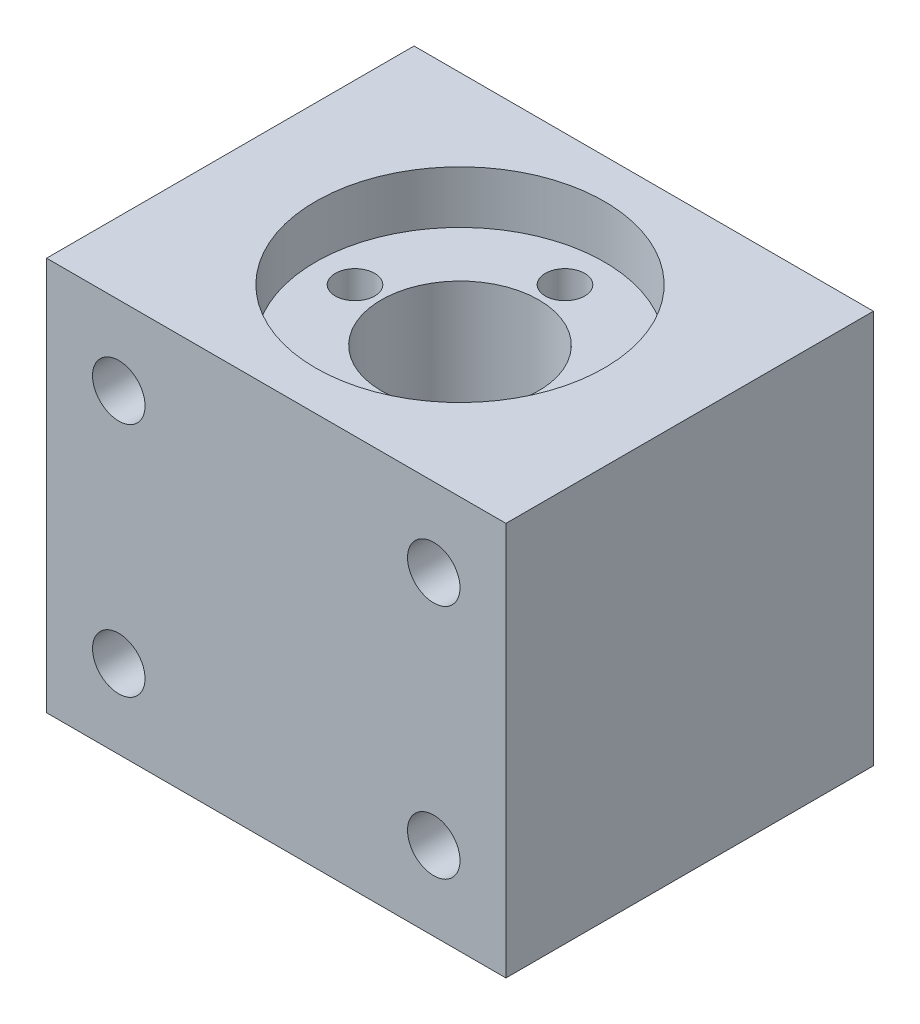
ISO-10303-21;
HEADER;
FILE_DESCRIPTION(('STEP AP214'),'2;1');
FILE_NAME('part.step','',(''),(''),'','','');
FILE_SCHEMA(('AUTOMOTIVE_DESIGN { 1 0 10303 214 1 1 1 1 }'));
ENDSEC;
DATA;
#1=APPLICATION_CONTEXT('core data for automotive mechanical design processes');
#2=APPLICATION_PROTOCOL_DEFINITION('international standard','automotive_design',2000,#1);
#3=PRODUCT_CONTEXT('',#1,'mechanical');
#4=PRODUCT('Part','Part','',(#3));
#5=PRODUCT_RELATED_PRODUCT_CATEGORY('part','',(#4));
#6=PRODUCT_DEFINITION_FORMATION('','',#4);
#7=PRODUCT_DEFINITION_CONTEXT('part definition',#1,'design');
#8=PRODUCT_DEFINITION('design','',#6,#7);
#9=PRODUCT_DEFINITION_SHAPE('','',#8);
#10=(LENGTH_UNIT() NAMED_UNIT(*) SI_UNIT(.MILLI.,.METRE.));
#11=(NAMED_UNIT(*) PLANE_ANGLE_UNIT() SI_UNIT($,.RADIAN.));
#12=(NAMED_UNIT(*) SI_UNIT($,.STERADIAN.) SOLID_ANGLE_UNIT());
#13=UNCERTAINTY_MEASURE_WITH_UNIT(LENGTH_MEASURE(1.E-05),#10,'distance_accuracy_value','');
#14=(GEOMETRIC_REPRESENTATION_CONTEXT(3) GLOBAL_UNCERTAINTY_ASSIGNED_CONTEXT((#13)) GLOBAL_UNIT_ASSIGNED_CONTEXT((#10,
#11,#12)) REPRESENTATION_CONTEXT('',''));
#15=CARTESIAN_POINT('',(0.,0.,0.));
#16=DIRECTION('',(0.,0.,1.));
#17=DIRECTION('',(1.,0.,0.));
#18=AXIS2_PLACEMENT_3D('',#15,#16,#17);
#19=CARTESIAN_POINT('',(17.5,58.,14.));
#20=DIRECTION('',(0.,-1.,0.));
#21=DIRECTION('',(0.,0.,-1.));
#22=AXIS2_PLACEMENT_3D('',#19,#20,#21);
#23=CYLINDRICAL_SURFACE('',#22,6.);
#24=CARTESIAN_POINT('',(17.5,8.,14.));
#25=DIRECTION('',(0.,-1.,0.));
#26=DIRECTION('',(0.,0.,-1.));
#27=AXIS2_PLACEMENT_3D('',#24,#25,#26);
#28=CIRCLE('',#27,6.);
#29=CARTESIAN_POINT('',(17.5,8.,8.));
#30=VERTEX_POINT('',#29);
#31=EDGE_CURVE('E145',#30,#30,#28,.T.);
#32=ORIENTED_EDGE('',*,*,#31,.T.);
#33=EDGE_LOOP('',(#32));
#34=FACE_BOUND('',#33,.T.);
#35=CARTESIAN_POINT('',(17.5,26.,14.));
#36=DIRECTION('',(0.,1.,0.));
#37=DIRECTION('',(0.,0.,1.));
#38=AXIS2_PLACEMENT_3D('',#35,#36,#37);
#39=CIRCLE('',#38,6.);
#40=CARTESIAN_POINT('',(17.5,26.,20.));
#41=VERTEX_POINT('',#40);
#42=EDGE_CURVE('E42',#41,#41,#39,.F.);
#43=ORIENTED_EDGE('',*,*,#42,.F.);
#44=EDGE_LOOP('',(#43));
#45=FACE_BOUND('',#44,.T.);
#46=ADVANCED_FACE('F38',(#34,#45),#23,.F.);
#47=CARTESIAN_POINT('',(0.,0.,28.));
#48=DIRECTION('',(1.,0.,0.));
#49=DIRECTION('',(0.,0.,-1.));
#50=AXIS2_PLACEMENT_3D('',#47,#48,#49);
#51=PLANE('',#50);
#52=DIRECTION('',(0.,-1.,0.));
#53=VECTOR('',#52,1.);
#54=CARTESIAN_POINT('',(0.,0.,0.));
#55=LINE('',#54,#53);
#56=CARTESIAN_POINT('',(0.,30.,0.));
#57=VERTEX_POINT('',#56);
#58=CARTESIAN_POINT('',(0.,0.,0.));
#59=VERTEX_POINT('',#58);
#60=EDGE_CURVE('E104',#57,#59,#55,.T.);
#61=ORIENTED_EDGE('',*,*,#60,.T.);
#62=DIRECTION('',(0.,0.,-1.));
#63=VECTOR('',#62,1.);
#64=CARTESIAN_POINT('',(0.,0.,28.));
#65=LINE('',#64,#63);
#66=CARTESIAN_POINT('',(0.,0.,28.));
#67=VERTEX_POINT('',#66);
#68=EDGE_CURVE('E11',#67,#59,#65,.T.);
#69=ORIENTED_EDGE('',*,*,#68,.F.);
#70=DIRECTION('',(0.,-1.,0.));
#71=VECTOR('',#70,1.);
#72=CARTESIAN_POINT('',(0.,0.,28.));
#73=LINE('',#72,#71);
#74=CARTESIAN_POINT('',(0.,30.,28.));
#75=VERTEX_POINT('',#74);
#76=EDGE_CURVE('E91',#75,#67,#73,.T.);
#77=ORIENTED_EDGE('',*,*,#76,.F.);
#78=DIRECTION('',(0.,0.,-1.));
#79=VECTOR('',#78,1.);
#80=CARTESIAN_POINT('',(0.,30.,28.));
#81=LINE('',#80,#79);
#82=EDGE_CURVE('E100',#75,#57,#81,.T.);
#83=ORIENTED_EDGE('',*,*,#82,.T.);
#84=EDGE_LOOP('',(#61,#69,#77,#83));
#85=FACE_BOUND('',#84,.T.);
#86=ADVANCED_FACE('F40',(#85),#51,.F.);
#87=CARTESIAN_POINT('',(0.,0.,28.));
#88=DIRECTION('',(0.,1.,0.));
#89=DIRECTION('',(0.,0.,1.));
#90=AXIS2_PLACEMENT_3D('',#87,#88,#89);
#91=PLANE('',#90);
#92=CARTESIAN_POINT('',(17.5,0.,14.));
#93=DIRECTION('',(0.,-1.,0.));
#94=DIRECTION('',(0.,0.,-1.));
#95=AXIS2_PLACEMENT_3D('',#92,#93,#94);
#96=CIRCLE('',#95,7.);
#97=CARTESIAN_POINT('',(17.5,0.,7.));
#98=VERTEX_POINT('',#97);
#99=EDGE_CURVE('E142',#98,#98,#96,.T.);
#100=ORIENTED_EDGE('',*,*,#99,.F.);
#101=EDGE_LOOP('',(#100));
#102=FACE_BOUND('',#101,.T.);
#103=DIRECTION('',(1.,0.,0.));
#104=VECTOR('',#103,1.);
#105=CARTESIAN_POINT('',(0.,0.,0.));
#106=LINE('',#105,#104);
#107=CARTESIAN_POINT('',(35.,0.,0.));
#108=VERTEX_POINT('',#107);
#109=EDGE_CURVE('E95',#59,#108,#106,.T.);
#110=ORIENTED_EDGE('',*,*,#109,.T.);
#111=DIRECTION('',(0.,0.,-1.));
#112=VECTOR('',#111,1.);
#113=CARTESIAN_POINT('',(35.,0.,28.));
#114=LINE('',#113,#112);
#115=CARTESIAN_POINT('',(35.,0.,28.));
#116=VERTEX_POINT('',#115);
#117=EDGE_CURVE('E48',#116,#108,#114,.T.);
#118=ORIENTED_EDGE('',*,*,#117,.F.);
#119=DIRECTION('',(1.,0.,0.));
#120=VECTOR('',#119,1.);
#121=CARTESIAN_POINT('',(0.,0.,28.));
#122=LINE('',#121,#120);
#123=EDGE_CURVE('E86',#67,#116,#122,.T.);
#124=ORIENTED_EDGE('',*,*,#123,.F.);
#125=ORIENTED_EDGE('',*,*,#68,.T.);
#126=EDGE_LOOP('',(#110,#118,#124,#125));
#127=FACE_BOUND('',#126,.T.);
#128=ADVANCED_FACE('F94',(#102,#127),#91,.F.);
#129=CARTESIAN_POINT('',(35.,0.,28.));
#130=DIRECTION('',(-1.,0.,0.));
#131=DIRECTION('',(0.,0.,1.));
#132=AXIS2_PLACEMENT_3D('',#129,#130,#131);
#133=PLANE('',#132);
#134=DIRECTION('',(0.,1.,0.));
#135=VECTOR('',#134,1.);
#136=CARTESIAN_POINT('',(35.,0.,0.));
#137=LINE('',#136,#135);
#138=CARTESIAN_POINT('',(35.,30.,0.));
#139=VERTEX_POINT('',#138);
#140=EDGE_CURVE('E73',#108,#139,#137,.T.);
#141=ORIENTED_EDGE('',*,*,#140,.T.);
#142=DIRECTION('',(0.,0.,-1.));
#143=VECTOR('',#142,1.);
#144=CARTESIAN_POINT('',(35.,30.,28.));
#145=LINE('',#144,#143);
#146=CARTESIAN_POINT('',(35.,30.,28.));
#147=VERTEX_POINT('',#146);
#148=EDGE_CURVE('E96',#147,#139,#145,.T.);
#149=ORIENTED_EDGE('',*,*,#148,.F.);
#150=DIRECTION('',(0.,1.,0.));
#151=VECTOR('',#150,1.);
#152=CARTESIAN_POINT('',(35.,0.,28.));
#153=LINE('',#152,#151);
#154=EDGE_CURVE('E89',#116,#147,#153,.T.);
#155=ORIENTED_EDGE('',*,*,#154,.F.);
#156=ORIENTED_EDGE('',*,*,#117,.T.);
#157=EDGE_LOOP('',(#141,#149,#155,#156));
#158=FACE_BOUND('',#157,.T.);
#159=ADVANCED_FACE('F98',(#158),#133,.F.);
#160=CARTESIAN_POINT('',(0.,30.,28.));
#161=DIRECTION('',(0.,-1.,0.));
#162=DIRECTION('',(0.,0.,-1.));
#163=AXIS2_PLACEMENT_3D('',#160,#161,#162);
#164=PLANE('',#163);
#165=CARTESIAN_POINT('',(17.5,30.,14.));
#166=DIRECTION('',(0.,1.,0.));
#167=DIRECTION('',(0.,0.,1.));
#168=AXIS2_PLACEMENT_3D('',#165,#166,#167);
#169=CIRCLE('',#168,11.);
#170=CARTESIAN_POINT('',(17.5,30.,25.));
#171=VERTEX_POINT('',#170);
#172=EDGE_CURVE('E150',#171,#171,#169,.T.);
#173=ORIENTED_EDGE('',*,*,#172,.F.);
#174=EDGE_LOOP('',(#173));
#175=FACE_BOUND('',#174,.T.);
#176=DIRECTION('',(-1.,0.,0.));
#177=VECTOR('',#176,1.);
#178=CARTESIAN_POINT('',(0.,30.,0.));
#179=LINE('',#178,#177);
#180=EDGE_CURVE('E79',#139,#57,#179,.T.);
#181=ORIENTED_EDGE('',*,*,#180,.T.);
#182=ORIENTED_EDGE('',*,*,#82,.F.);
#183=DIRECTION('',(-1.,0.,0.));
#184=VECTOR('',#183,1.);
#185=CARTESIAN_POINT('',(0.,30.,28.));
#186=LINE('',#185,#184);
#187=EDGE_CURVE('E56',#147,#75,#186,.T.);
#188=ORIENTED_EDGE('',*,*,#187,.F.);
#189=ORIENTED_EDGE('',*,*,#148,.T.);
#190=EDGE_LOOP('',(#181,#182,#188,#189));
#191=FACE_BOUND('',#190,.T.);
#192=ADVANCED_FACE('F112',(#175,#191),#164,.F.);
#193=CARTESIAN_POINT('',(0.,0.,28.));
#194=DIRECTION('',(0.,0.,-1.));
#195=DIRECTION('',(-1.,0.,0.));
#196=AXIS2_PLACEMENT_3D('',#193,#194,#195);
#197=PLANE('',#196);
#198=CARTESIAN_POINT('',(29.5,24.,28.));
#199=DIRECTION('',(0.,0.,1.));
#200=DIRECTION('',(1.,0.,0.));
#201=AXIS2_PLACEMENT_3D('',#198,#199,#200);
#202=CIRCLE('',#201,2.);
#203=CARTESIAN_POINT('',(31.5,24.,28.));
#204=VERTEX_POINT('',#203);
#205=EDGE_CURVE('E124',#204,#204,#202,.T.);
#206=ORIENTED_EDGE('',*,*,#205,.F.);
#207=EDGE_LOOP('',(#206));
#208=FACE_BOUND('',#207,.T.);
#209=CARTESIAN_POINT('',(29.5,6.,28.));
#210=DIRECTION('',(0.,0.,1.));
#211=DIRECTION('',(1.,0.,0.));
#212=AXIS2_PLACEMENT_3D('',#209,#210,#211);
#213=CIRCLE('',#212,2.);
#214=CARTESIAN_POINT('',(31.5,6.,28.));
#215=VERTEX_POINT('',#214);
#216=EDGE_CURVE('E131',#215,#215,#213,.T.);
#217=ORIENTED_EDGE('',*,*,#216,.F.);
#218=EDGE_LOOP('',(#217));
#219=FACE_BOUND('',#218,.T.);
#220=CARTESIAN_POINT('',(5.5,6.,28.));
#221=DIRECTION('',(0.,0.,1.));
#222=DIRECTION('',(1.,0.,0.));
#223=AXIS2_PLACEMENT_3D('',#220,#221,#222);
#224=CIRCLE('',#223,2.);
#225=CARTESIAN_POINT('',(7.5,6.,28.));
#226=VERTEX_POINT('',#225);
#227=EDGE_CURVE('E137',#226,#226,#224,.T.);
#228=ORIENTED_EDGE('',*,*,#227,.F.);
#229=EDGE_LOOP('',(#228));
#230=FACE_BOUND('',#229,.T.);
#231=CARTESIAN_POINT('',(5.5,24.,28.));
#232=DIRECTION('',(0.,0.,1.));
#233=DIRECTION('',(1.,0.,0.));
#234=AXIS2_PLACEMENT_3D('',#231,#232,#233);
#235=CIRCLE('',#234,2.);
#236=CARTESIAN_POINT('',(7.5,24.,28.));
#237=VERTEX_POINT('',#236);
#238=EDGE_CURVE('E118',#237,#237,#235,.T.);
#239=ORIENTED_EDGE('',*,*,#238,.F.);
#240=EDGE_LOOP('',(#239));
#241=FACE_BOUND('',#240,.T.);
#242=ORIENTED_EDGE('',*,*,#76,.T.);
#243=ORIENTED_EDGE('',*,*,#123,.T.);
#244=ORIENTED_EDGE('',*,*,#154,.T.);
#245=ORIENTED_EDGE('',*,*,#187,.T.);
#246=EDGE_LOOP('',(#242,#243,#244,#245));
#247=FACE_BOUND('',#246,.T.);
#248=ADVANCED_FACE('F87',(#208,#219,#230,#241,#247),#197,.F.);
#249=CARTESIAN_POINT('',(0.,0.,0.));
#250=DIRECTION('',(0.,0.,-1.));
#251=DIRECTION('',(-1.,0.,0.));
#252=AXIS2_PLACEMENT_3D('',#249,#250,#251);
#253=PLANE('',#252);
#254=CARTESIAN_POINT('',(5.,15.,0.));
#255=DIRECTION('',(0.,0.,-1.));
#256=DIRECTION('',(-1.,0.,0.));
#257=AXIS2_PLACEMENT_3D('',#254,#255,#256);
#258=CIRCLE('',#257,1.5);
#259=CARTESIAN_POINT('',(3.5,15.,0.));
#260=VERTEX_POINT('',#259);
#261=EDGE_CURVE('E181',#260,#260,#258,.T.);
#262=ORIENTED_EDGE('',*,*,#261,.F.);
#263=EDGE_LOOP('',(#262));
#264=FACE_BOUND('',#263,.T.);
#265=ORIENTED_EDGE('',*,*,#60,.F.);
#266=ORIENTED_EDGE('',*,*,#180,.F.);
#267=ORIENTED_EDGE('',*,*,#140,.F.);
#268=ORIENTED_EDGE('',*,*,#109,.F.);
#269=EDGE_LOOP('',(#265,#266,#267,#268));
#270=FACE_BOUND('',#269,.T.);
#271=ADVANCED_FACE('F115',(#264,#270),#253,.T.);
#272=CARTESIAN_POINT('',(5.5,24.,21.));
#273=DIRECTION('',(0.,0.,1.));
#274=DIRECTION('',(1.,0.,0.));
#275=AXIS2_PLACEMENT_3D('',#272,#273,#274);
#276=CYLINDRICAL_SURFACE('',#275,2.);
#277=CARTESIAN_POINT('',(5.5,24.,21.));
#278=DIRECTION('',(0.,0.,1.));
#279=DIRECTION('',(1.,0.,0.));
#280=AXIS2_PLACEMENT_3D('',#277,#278,#279);
#281=CIRCLE('',#280,2.);
#282=CARTESIAN_POINT('',(7.5,24.,21.));
#283=VERTEX_POINT('',#282);
#284=EDGE_CURVE('E107',#283,#283,#281,.T.);
#285=ORIENTED_EDGE('',*,*,#284,.F.);
#286=EDGE_LOOP('',(#285));
#287=FACE_BOUND('',#286,.T.);
#288=ORIENTED_EDGE('',*,*,#238,.T.);
#289=EDGE_LOOP('',(#288));
#290=FACE_BOUND('',#289,.T.);
#291=ADVANCED_FACE('F197',(#287,#290),#276,.F.);
#292=CARTESIAN_POINT('',(5.5,24.,21.));
#293=DIRECTION('',(0.,0.,1.));
#294=DIRECTION('',(1.,0.,0.));
#295=AXIS2_PLACEMENT_3D('',#292,#293,#294);
#296=PLANE('',#295);
#297=ORIENTED_EDGE('',*,*,#284,.T.);
#298=EDGE_LOOP('',(#297));
#299=FACE_BOUND('',#298,.T.);
#300=ADVANCED_FACE('F203',(#299),#296,.T.);
#301=CARTESIAN_POINT('',(5.5,6.,21.));
#302=DIRECTION('',(0.,0.,1.));
#303=DIRECTION('',(1.,0.,0.));
#304=AXIS2_PLACEMENT_3D('',#301,#302,#303);
#305=CYLINDRICAL_SURFACE('',#304,2.);
#306=CARTESIAN_POINT('',(5.5,6.,21.));
#307=DIRECTION('',(0.,0.,1.));
#308=DIRECTION('',(1.,0.,0.));
#309=AXIS2_PLACEMENT_3D('',#306,#307,#308);
#310=CIRCLE('',#309,2.);
#311=CARTESIAN_POINT('',(7.5,6.,21.));
#312=VERTEX_POINT('',#311);
#313=EDGE_CURVE('E121',#312,#312,#310,.T.);
#314=ORIENTED_EDGE('',*,*,#313,.F.);
#315=EDGE_LOOP('',(#314));
#316=FACE_BOUND('',#315,.T.);
#317=ORIENTED_EDGE('',*,*,#227,.T.);
#318=EDGE_LOOP('',(#317));
#319=FACE_BOUND('',#318,.T.);
#320=ADVANCED_FACE('F234',(#316,#319),#305,.F.);
#321=CARTESIAN_POINT('',(5.5,6.,21.));
#322=DIRECTION('',(0.,0.,1.));
#323=DIRECTION('',(1.,0.,0.));
#324=AXIS2_PLACEMENT_3D('',#321,#322,#323);
#325=PLANE('',#324);
#326=ORIENTED_EDGE('',*,*,#313,.T.);
#327=EDGE_LOOP('',(#326));
#328=FACE_BOUND('',#327,.T.);
#329=ADVANCED_FACE('F230',(#328),#325,.T.);
#330=CARTESIAN_POINT('',(29.5,6.,21.));
#331=DIRECTION('',(0.,0.,1.));
#332=DIRECTION('',(1.,0.,0.));
#333=AXIS2_PLACEMENT_3D('',#330,#331,#332);
#334=CYLINDRICAL_SURFACE('',#333,2.);
#335=CARTESIAN_POINT('',(29.5,6.,21.));
#336=DIRECTION('',(0.,0.,1.));
#337=DIRECTION('',(1.,0.,0.));
#338=AXIS2_PLACEMENT_3D('',#335,#336,#337);
#339=CIRCLE('',#338,2.);
#340=CARTESIAN_POINT('',(31.5,6.,21.));
#341=VERTEX_POINT('',#340);
#342=EDGE_CURVE('E134',#341,#341,#339,.T.);
#343=ORIENTED_EDGE('',*,*,#342,.F.);
#344=EDGE_LOOP('',(#343));
#345=FACE_BOUND('',#344,.T.);
#346=ORIENTED_EDGE('',*,*,#216,.T.);
#347=EDGE_LOOP('',(#346));
#348=FACE_BOUND('',#347,.T.);
#349=ADVANCED_FACE('F233',(#345,#348),#334,.F.);
#350=CARTESIAN_POINT('',(29.5,6.,21.));
#351=DIRECTION('',(0.,0.,1.));
#352=DIRECTION('',(1.,0.,0.));
#353=AXIS2_PLACEMENT_3D('',#350,#351,#352);
#354=PLANE('',#353);
#355=ORIENTED_EDGE('',*,*,#342,.T.);
#356=EDGE_LOOP('',(#355));
#357=FACE_BOUND('',#356,.T.);
#358=ADVANCED_FACE('F239',(#357),#354,.T.);
#359=CARTESIAN_POINT('',(29.5,24.,21.));
#360=DIRECTION('',(0.,0.,1.));
#361=DIRECTION('',(1.,0.,0.));
#362=AXIS2_PLACEMENT_3D('',#359,#360,#361);
#363=CYLINDRICAL_SURFACE('',#362,2.);
#364=CARTESIAN_POINT('',(29.5,24.,21.));
#365=DIRECTION('',(0.,0.,1.));
#366=DIRECTION('',(1.,0.,0.));
#367=AXIS2_PLACEMENT_3D('',#364,#365,#366);
#368=CIRCLE('',#367,2.);
#369=CARTESIAN_POINT('',(31.5,24.,21.));
#370=VERTEX_POINT('',#369);
#371=EDGE_CURVE('E127',#370,#370,#368,.T.);
#372=ORIENTED_EDGE('',*,*,#371,.F.);
#373=EDGE_LOOP('',(#372));
#374=FACE_BOUND('',#373,.T.);
#375=ORIENTED_EDGE('',*,*,#205,.T.);
#376=EDGE_LOOP('',(#375));
#377=FACE_BOUND('',#376,.T.);
#378=ADVANCED_FACE('F242',(#374,#377),#363,.F.);
#379=CARTESIAN_POINT('',(29.5,24.,21.));
#380=DIRECTION('',(0.,0.,1.));
#381=DIRECTION('',(1.,0.,0.));
#382=AXIS2_PLACEMENT_3D('',#379,#380,#381);
#383=PLANE('',#382);
#384=ORIENTED_EDGE('',*,*,#371,.T.);
#385=EDGE_LOOP('',(#384));
#386=FACE_BOUND('',#385,.T.);
#387=ADVANCED_FACE('F228',(#386),#383,.T.);
#388=CARTESIAN_POINT('',(17.5,8.,14.));
#389=DIRECTION('',(0.,-1.,0.));
#390=DIRECTION('',(0.,0.,-1.));
#391=AXIS2_PLACEMENT_3D('',#388,#389,#390);
#392=CYLINDRICAL_SURFACE('',#391,7.);
#393=CARTESIAN_POINT('',(17.5,8.,14.));
#394=DIRECTION('',(0.,-1.,0.));
#395=DIRECTION('',(0.,0.,-1.));
#396=AXIS2_PLACEMENT_3D('',#393,#394,#395);
#397=CIRCLE('',#396,7.);
#398=CARTESIAN_POINT('',(17.5,8.,7.));
#399=VERTEX_POINT('',#398);
#400=EDGE_CURVE('E128',#399,#399,#397,.T.);
#401=ORIENTED_EDGE('',*,*,#400,.F.);
#402=EDGE_LOOP('',(#401));
#403=FACE_BOUND('',#402,.T.);
#404=ORIENTED_EDGE('',*,*,#99,.T.);
#405=EDGE_LOOP('',(#404));
#406=FACE_BOUND('',#405,.T.);
#407=ADVANCED_FACE('F224',(#403,#406),#392,.F.);
#408=CARTESIAN_POINT('',(17.5,8.,14.));
#409=DIRECTION('',(0.,-1.,0.));
#410=DIRECTION('',(0.,0.,-1.));
#411=AXIS2_PLACEMENT_3D('',#408,#409,#410);
#412=PLANE('',#411);
#413=ORIENTED_EDGE('',*,*,#31,.F.);
#414=EDGE_LOOP('',(#413));
#415=FACE_BOUND('',#414,.T.);
#416=ORIENTED_EDGE('',*,*,#400,.T.);
#417=EDGE_LOOP('',(#416));
#418=FACE_BOUND('',#417,.T.);
#419=ADVANCED_FACE('F220',(#415,#418),#412,.T.);
#420=CARTESIAN_POINT('',(17.5,26.,14.));
#421=DIRECTION('',(0.,1.,0.));
#422=DIRECTION('',(0.,0.,1.));
#423=AXIS2_PLACEMENT_3D('',#420,#421,#422);
#424=PLANE('',#423);
#425=CARTESIAN_POINT('',(17.5,26.,6.));
#426=DIRECTION('',(0.,1.,0.));
#427=DIRECTION('',(0.,0.,1.));
#428=AXIS2_PLACEMENT_3D('',#425,#426,#427);
#429=CIRCLE('',#428,1.5);
#430=CARTESIAN_POINT('',(17.5,26.,7.5));
#431=VERTEX_POINT('',#430);
#432=EDGE_CURVE('E176',#431,#431,#429,.T.);
#433=ORIENTED_EDGE('',*,*,#432,.F.);
#434=EDGE_LOOP('',(#433));
#435=FACE_BOUND('',#434,.T.);
#436=CARTESIAN_POINT('',(9.5,26.,14.));
#437=DIRECTION('',(0.,1.,0.));
#438=DIRECTION('',(0.,0.,1.));
#439=AXIS2_PLACEMENT_3D('',#436,#437,#438);
#440=CIRCLE('',#439,1.5);
#441=CARTESIAN_POINT('',(9.5,26.,15.5));
#442=VERTEX_POINT('',#441);
#443=EDGE_CURVE('E170',#442,#442,#440,.T.);
#444=ORIENTED_EDGE('',*,*,#443,.F.);
#445=EDGE_LOOP('',(#444));
#446=FACE_BOUND('',#445,.T.);
#447=CARTESIAN_POINT('',(17.5,26.,22.));
#448=DIRECTION('',(0.,1.,0.));
#449=DIRECTION('',(0.,0.,1.));
#450=AXIS2_PLACEMENT_3D('',#447,#448,#449);
#451=CIRCLE('',#450,1.5);
#452=CARTESIAN_POINT('',(17.5,26.,23.5));
#453=VERTEX_POINT('',#452);
#454=EDGE_CURVE('E164',#453,#453,#451,.T.);
#455=ORIENTED_EDGE('',*,*,#454,.F.);
#456=EDGE_LOOP('',(#455));
#457=FACE_BOUND('',#456,.T.);
#458=CARTESIAN_POINT('',(25.5,26.,14.));
#459=DIRECTION('',(0.,1.,0.));
#460=DIRECTION('',(0.,0.,1.));
#461=AXIS2_PLACEMENT_3D('',#458,#459,#460);
#462=CIRCLE('',#461,1.5);
#463=CARTESIAN_POINT('',(25.5,26.,15.5));
#464=VERTEX_POINT('',#463);
#465=EDGE_CURVE('E157',#464,#464,#462,.T.);
#466=ORIENTED_EDGE('',*,*,#465,.F.);
#467=EDGE_LOOP('',(#466));
#468=FACE_BOUND('',#467,.T.);
#469=CARTESIAN_POINT('',(17.5,26.,14.));
#470=DIRECTION('',(0.,1.,0.));
#471=DIRECTION('',(0.,0.,1.));
#472=AXIS2_PLACEMENT_3D('',#469,#470,#471);
#473=CIRCLE('',#472,11.);
#474=CARTESIAN_POINT('',(17.5,26.,25.));
#475=VERTEX_POINT('',#474);
#476=EDGE_CURVE('E153',#475,#475,#473,.T.);
#477=ORIENTED_EDGE('',*,*,#476,.T.);
#478=EDGE_LOOP('',(#477));
#479=FACE_BOUND('',#478,.T.);
#480=ORIENTED_EDGE('',*,*,#42,.T.);
#481=EDGE_LOOP('',(#480));
#482=FACE_BOUND('',#481,.T.);
#483=ADVANCED_FACE('F223',(#435,#446,#457,#468,#479,#482),#424,.T.);
#484=CARTESIAN_POINT('',(17.5,26.,14.));
#485=DIRECTION('',(0.,1.,0.));
#486=DIRECTION('',(0.,0.,1.));
#487=AXIS2_PLACEMENT_3D('',#484,#485,#486);
#488=CYLINDRICAL_SURFACE('',#487,11.);
#489=ORIENTED_EDGE('',*,*,#476,.F.);
#490=EDGE_LOOP('',(#489));
#491=FACE_BOUND('',#490,.T.);
#492=ORIENTED_EDGE('',*,*,#172,.T.);
#493=EDGE_LOOP('',(#492));
#494=FACE_BOUND('',#493,.T.);
#495=ADVANCED_FACE('F218',(#491,#494),#488,.F.);
#496=CARTESIAN_POINT('',(25.5,16.,14.));
#497=DIRECTION('',(0.,1.,0.));
#498=DIRECTION('',(0.,0.,1.));
#499=AXIS2_PLACEMENT_3D('',#496,#497,#498);
#500=CYLINDRICAL_SURFACE('',#499,1.5);
#501=CARTESIAN_POINT('',(25.5,16.,14.));
#502=DIRECTION('',(0.,1.,0.));
#503=DIRECTION('',(0.,0.,1.));
#504=AXIS2_PLACEMENT_3D('',#501,#502,#503);
#505=CIRCLE('',#504,1.5);
#506=CARTESIAN_POINT('',(25.5,16.,15.5));
#507=VERTEX_POINT('',#506);
#508=EDGE_CURVE('E160',#507,#507,#505,.T.);
#509=ORIENTED_EDGE('',*,*,#508,.F.);
#510=EDGE_LOOP('',(#509));
#511=FACE_BOUND('',#510,.T.);
#512=ORIENTED_EDGE('',*,*,#465,.T.);
#513=EDGE_LOOP('',(#512));
#514=FACE_BOUND('',#513,.T.);
#515=ADVANCED_FACE('F309',(#511,#514),#500,.F.);
#516=CARTESIAN_POINT('',(25.5,16.,14.));
#517=DIRECTION('',(0.,1.,0.));
#518=DIRECTION('',(0.,0.,1.));
#519=AXIS2_PLACEMENT_3D('',#516,#517,#518);
#520=PLANE('',#519);
#521=ORIENTED_EDGE('',*,*,#508,.T.);
#522=EDGE_LOOP('',(#521));
#523=FACE_BOUND('',#522,.T.);
#524=ADVANCED_FACE('F316',(#523),#520,.T.);
#525=CARTESIAN_POINT('',(17.5,16.,22.));
#526=DIRECTION('',(0.,1.,0.));
#527=DIRECTION('',(0.,0.,1.));
#528=AXIS2_PLACEMENT_3D('',#525,#526,#527);
#529=CYLINDRICAL_SURFACE('',#528,1.5);
#530=CARTESIAN_POINT('',(17.5,16.,22.));
#531=DIRECTION('',(0.,1.,0.));
#532=DIRECTION('',(0.,0.,1.));
#533=AXIS2_PLACEMENT_3D('',#530,#531,#532);
#534=CIRCLE('',#533,1.5);
#535=CARTESIAN_POINT('',(17.5,16.,23.5));
#536=VERTEX_POINT('',#535);
#537=EDGE_CURVE('E167',#536,#536,#534,.T.);
#538=ORIENTED_EDGE('',*,*,#537,.F.);
#539=EDGE_LOOP('',(#538));
#540=FACE_BOUND('',#539,.T.);
#541=ORIENTED_EDGE('',*,*,#454,.T.);
#542=EDGE_LOOP('',(#541));
#543=FACE_BOUND('',#542,.T.);
#544=ADVANCED_FACE('F324',(#540,#543),#529,.F.);
#545=CARTESIAN_POINT('',(17.5,16.,22.));
#546=DIRECTION('',(0.,1.,0.));
#547=DIRECTION('',(0.,0.,1.));
#548=AXIS2_PLACEMENT_3D('',#545,#546,#547);
#549=PLANE('',#548);
#550=ORIENTED_EDGE('',*,*,#537,.T.);
#551=EDGE_LOOP('',(#550));
#552=FACE_BOUND('',#551,.T.);
#553=ADVANCED_FACE('F332',(#552),#549,.T.);
#554=CARTESIAN_POINT('',(9.5,16.,14.));
#555=DIRECTION('',(0.,1.,0.));
#556=DIRECTION('',(0.,0.,1.));
#557=AXIS2_PLACEMENT_3D('',#554,#555,#556);
#558=CYLINDRICAL_SURFACE('',#557,1.5);
#559=CARTESIAN_POINT('',(9.5,16.,14.));
#560=DIRECTION('',(0.,1.,0.));
#561=DIRECTION('',(0.,0.,1.));
#562=AXIS2_PLACEMENT_3D('',#559,#560,#561);
#563=CIRCLE('',#562,1.5);
#564=CARTESIAN_POINT('',(9.5,16.,15.5));
#565=VERTEX_POINT('',#564);
#566=EDGE_CURVE('E173',#565,#565,#563,.T.);
#567=ORIENTED_EDGE('',*,*,#566,.F.);
#568=EDGE_LOOP('',(#567));
#569=FACE_BOUND('',#568,.T.);
#570=ORIENTED_EDGE('',*,*,#443,.T.);
#571=EDGE_LOOP('',(#570));
#572=FACE_BOUND('',#571,.T.);
#573=ADVANCED_FACE('F340',(#569,#572),#558,.F.);
#574=CARTESIAN_POINT('',(9.5,16.,14.));
#575=DIRECTION('',(0.,1.,0.));
#576=DIRECTION('',(0.,0.,1.));
#577=AXIS2_PLACEMENT_3D('',#574,#575,#576);
#578=PLANE('',#577);
#579=ORIENTED_EDGE('',*,*,#566,.T.);
#580=EDGE_LOOP('',(#579));
#581=FACE_BOUND('',#580,.T.);
#582=ADVANCED_FACE('F348',(#581),#578,.T.);
#583=CARTESIAN_POINT('',(17.5,16.,6.));
#584=DIRECTION('',(0.,1.,0.));
#585=DIRECTION('',(0.,0.,1.));
#586=AXIS2_PLACEMENT_3D('',#583,#584,#585);
#587=CYLINDRICAL_SURFACE('',#586,1.5);
#588=CARTESIAN_POINT('',(17.5,16.,6.));
#589=DIRECTION('',(0.,1.,0.));
#590=DIRECTION('',(0.,0.,1.));
#591=AXIS2_PLACEMENT_3D('',#588,#589,#590);
#592=CIRCLE('',#591,1.5);
#593=CARTESIAN_POINT('',(17.5,16.,7.5));
#594=VERTEX_POINT('',#593);
#595=EDGE_CURVE('E154',#594,#594,#592,.T.);
#596=ORIENTED_EDGE('',*,*,#595,.F.);
#597=EDGE_LOOP('',(#596));
#598=FACE_BOUND('',#597,.T.);
#599=ORIENTED_EDGE('',*,*,#432,.T.);
#600=EDGE_LOOP('',(#599));
#601=FACE_BOUND('',#600,.T.);
#602=ADVANCED_FACE('F356',(#598,#601),#587,.F.);
#603=CARTESIAN_POINT('',(17.5,16.,6.));
#604=DIRECTION('',(0.,1.,0.));
#605=DIRECTION('',(0.,0.,1.));
#606=AXIS2_PLACEMENT_3D('',#603,#604,#605);
#607=PLANE('',#606);
#608=ORIENTED_EDGE('',*,*,#595,.T.);
#609=EDGE_LOOP('',(#608));
#610=FACE_BOUND('',#609,.T.);
#611=ADVANCED_FACE('F192',(#610),#607,.T.);
#612=CARTESIAN_POINT('',(5.,15.,10.));
#613=DIRECTION('',(0.,0.,-1.));
#614=DIRECTION('',(-1.,0.,0.));
#615=AXIS2_PLACEMENT_3D('',#612,#613,#614);
#616=CYLINDRICAL_SURFACE('',#615,1.5);
#617=CARTESIAN_POINT('',(5.,15.,10.));
#618=DIRECTION('',(0.,0.,-1.));
#619=DIRECTION('',(-1.,0.,0.));
#620=AXIS2_PLACEMENT_3D('',#617,#618,#619);
#621=CIRCLE('',#620,1.5);
#622=CARTESIAN_POINT('',(3.5,15.,10.));
#623=VERTEX_POINT('',#622);
#624=EDGE_CURVE('E161',#623,#623,#621,.T.);
#625=ORIENTED_EDGE('',*,*,#624,.F.);
#626=EDGE_LOOP('',(#625));
#627=FACE_BOUND('',#626,.T.);
#628=ORIENTED_EDGE('',*,*,#261,.T.);
#629=EDGE_LOOP('',(#628));
#630=FACE_BOUND('',#629,.T.);
#631=ADVANCED_FACE('F189',(#627,#630),#616,.F.);
#632=CARTESIAN_POINT('',(5.,15.,10.));
#633=DIRECTION('',(0.,0.,-1.));
#634=DIRECTION('',(-1.,0.,0.));
#635=AXIS2_PLACEMENT_3D('',#632,#633,#634);
#636=PLANE('',#635);
#637=ORIENTED_EDGE('',*,*,#624,.T.);
#638=EDGE_LOOP('',(#637));
#639=FACE_BOUND('',#638,.T.);
#640=ADVANCED_FACE('F187',(#639),#636,.T.);
#641=CLOSED_SHELL('',(#46,#86,#128,#159,#192,#248,#271,#291,#300,#320,#329,#349,#358,#378,#387,
#407,#419,#483,#495,#515,#524,#544,#553,#573,#582,#602,#611,#631,#640));
#642=MANIFOLD_SOLID_BREP('B2',#641);
#643=ADVANCED_BREP_SHAPE_REPRESENTATION('',(#18,#642),#14);
#644=SHAPE_DEFINITION_REPRESENTATION(#9,#643);
ENDSEC;
END-ISO-10303-21;
